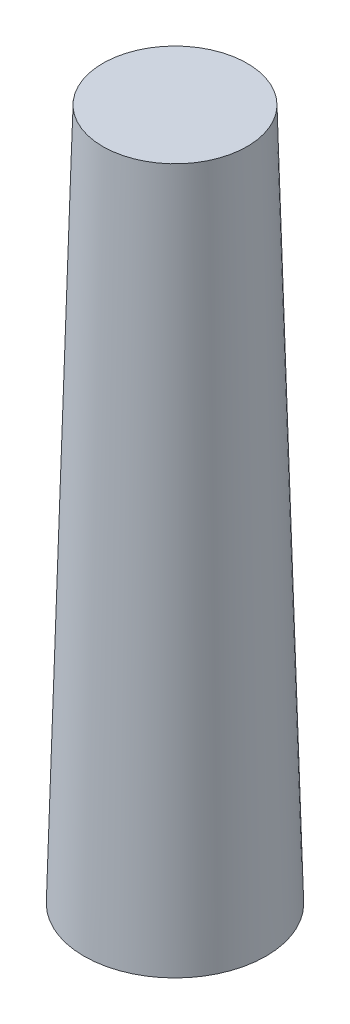
ISO-10303-21;
HEADER;
FILE_DESCRIPTION(('STEP AP214'),'2;1');
FILE_NAME('part.step','',(''),(''),'','','');
FILE_SCHEMA(('AUTOMOTIVE_DESIGN { 1 0 10303 214 1 1 1 1 }'));
ENDSEC;
DATA;
#1=APPLICATION_CONTEXT('core data for automotive mechanical design processes');
#2=APPLICATION_PROTOCOL_DEFINITION('international standard','automotive_design',2000,#1);
#3=PRODUCT_CONTEXT('',#1,'mechanical');
#4=PRODUCT('Part','Part','',(#3));
#5=PRODUCT_RELATED_PRODUCT_CATEGORY('part','',(#4));
#6=PRODUCT_DEFINITION_FORMATION('','',#4);
#7=PRODUCT_DEFINITION_CONTEXT('part definition',#1,'design');
#8=PRODUCT_DEFINITION('design','',#6,#7);
#9=PRODUCT_DEFINITION_SHAPE('','',#8);
#10=(LENGTH_UNIT() NAMED_UNIT(*) SI_UNIT(.MILLI.,.METRE.));
#11=(NAMED_UNIT(*) PLANE_ANGLE_UNIT() SI_UNIT($,.RADIAN.));
#12=(NAMED_UNIT(*) SI_UNIT($,.STERADIAN.) SOLID_ANGLE_UNIT());
#13=UNCERTAINTY_MEASURE_WITH_UNIT(LENGTH_MEASURE(1.E-05),#10,'distance_accuracy_value','');
#14=(GEOMETRIC_REPRESENTATION_CONTEXT(3) GLOBAL_UNCERTAINTY_ASSIGNED_CONTEXT((#13)) GLOBAL_UNIT_ASSIGNED_CONTEXT((#10,
#11,#12)) REPRESENTATION_CONTEXT('',''));
#15=CARTESIAN_POINT('',(0.,0.,0.));
#16=DIRECTION('',(0.,0.,1.));
#17=DIRECTION('',(1.,0.,0.));
#18=AXIS2_PLACEMENT_3D('',#15,#16,#17);
#19=CARTESIAN_POINT('',(-7.5,0.,0.));
#20=DIRECTION('',(0.,-1.,0.));
#21=DIRECTION('',(0.,0.,-1.));
#22=AXIS2_PLACEMENT_3D('',#19,#20,#21);
#23=PLANE('',#22);
#24=CARTESIAN_POINT('',(0.,0.,0.));
#25=DIRECTION('',(0.,1.,0.));
#26=DIRECTION('',(0.,0.,1.));
#27=AXIS2_PLACEMENT_3D('',#24,#25,#26);
#28=CIRCLE('',#27,5.5);
#29=CARTESIAN_POINT('',(0.,0.,5.5));
#30=VERTEX_POINT('',#29);
#31=EDGE_CURVE('E10',#30,#30,#28,.T.);
#32=ORIENTED_EDGE('',*,*,#31,.T.);
#33=EDGE_LOOP('',(#32));
#34=FACE_BOUND('',#33,.T.);
#35=CARTESIAN_POINT('',(0.,0.,0.));
#36=DIRECTION('',(0.,1.,0.));
#37=DIRECTION('',(0.,0.,1.));
#38=AXIS2_PLACEMENT_3D('',#35,#36,#37);
#39=CIRCLE('',#38,7.5);
#40=CARTESIAN_POINT('',(0.,0.,7.5));
#41=VERTEX_POINT('',#40);
#42=EDGE_CURVE('E46',#41,#41,#39,.T.);
#43=ORIENTED_EDGE('',*,*,#42,.F.);
#44=EDGE_LOOP('',(#43));
#45=FACE_BOUND('',#44,.T.);
#46=ADVANCED_FACE('F32',(#34,#45),#23,.T.);
#47=CARTESIAN_POINT('',(0.,0.,0.));
#48=DIRECTION('',(0.,-1.,0.));
#49=DIRECTION('',(0.,0.,-1.));
#50=AXIS2_PLACEMENT_3D('',#47,#48,#49);
#51=CONICAL_SURFACE('',#50,5.5,0.0272659684555945);
#52=CARTESIAN_POINT('',(0.,55.,0.));
#53=DIRECTION('',(0.,1.,0.));
#54=DIRECTION('',(0.,0.,1.));
#55=AXIS2_PLACEMENT_3D('',#52,#53,#54);
#56=CIRCLE('',#55,4.);
#57=CARTESIAN_POINT('',(0.,55.,4.));
#58=VERTEX_POINT('',#57);
#59=EDGE_CURVE('E38',#58,#58,#56,.T.);
#60=ORIENTED_EDGE('',*,*,#59,.T.);
#61=EDGE_LOOP('',(#60));
#62=FACE_BOUND('',#61,.T.);
#63=ORIENTED_EDGE('',*,*,#31,.F.);
#64=EDGE_LOOP('',(#63));
#65=FACE_BOUND('',#64,.T.);
#66=ADVANCED_FACE('F56',(#62,#65),#51,.F.);
#67=CARTESIAN_POINT('',(-4.,55.,0.));
#68=DIRECTION('',(0.,-1.,0.));
#69=DIRECTION('',(0.,0.,-1.));
#70=AXIS2_PLACEMENT_3D('',#67,#68,#69);
#71=PLANE('',#70);
#72=ORIENTED_EDGE('',*,*,#59,.F.);
#73=EDGE_LOOP('',(#72));
#74=FACE_BOUND('',#73,.T.);
#75=ADVANCED_FACE('F60',(#74),#71,.T.);
#76=CARTESIAN_POINT('',(0.,57.,0.));
#77=DIRECTION('',(0.,1.,0.));
#78=DIRECTION('',(0.,0.,1.));
#79=AXIS2_PLACEMENT_3D('',#76,#77,#78);
#80=PLANE('',#79);
#81=CARTESIAN_POINT('',(0.,57.,0.));
#82=DIRECTION('',(0.,1.,0.));
#83=DIRECTION('',(0.,0.,1.));
#84=AXIS2_PLACEMENT_3D('',#81,#82,#83);
#85=CIRCLE('',#84,5.94545454545455);
#86=CARTESIAN_POINT('',(0.,57.,5.94545454545455));
#87=VERTEX_POINT('',#86);
#88=EDGE_CURVE('E42',#87,#87,#85,.T.);
#89=ORIENTED_EDGE('',*,*,#88,.T.);
#90=EDGE_LOOP('',(#89));
#91=FACE_BOUND('',#90,.T.);
#92=ADVANCED_FACE('F64',(#91),#80,.T.);
#93=CARTESIAN_POINT('',(0.,57.,0.));
#94=DIRECTION('',(0.,-1.,0.));
#95=DIRECTION('',(0.,0.,-1.));
#96=AXIS2_PLACEMENT_3D('',#93,#94,#95);
#97=CONICAL_SURFACE('',#96,5.94545454545455,0.0272659684555944);
#98=ORIENTED_EDGE('',*,*,#42,.T.);
#99=EDGE_LOOP('',(#98));
#100=FACE_BOUND('',#99,.T.);
#101=ORIENTED_EDGE('',*,*,#88,.F.);
#102=EDGE_LOOP('',(#101));
#103=FACE_BOUND('',#102,.T.);
#104=ADVANCED_FACE('F52',(#100,#103),#97,.T.);
#105=CLOSED_SHELL('',(#46,#66,#75,#92,#104));
#106=MANIFOLD_SOLID_BREP('B2',#105);
#107=ADVANCED_BREP_SHAPE_REPRESENTATION('',(#18,#106),#14);
#108=SHAPE_DEFINITION_REPRESENTATION(#9,#107);
ENDSEC;
END-ISO-10303-21;
